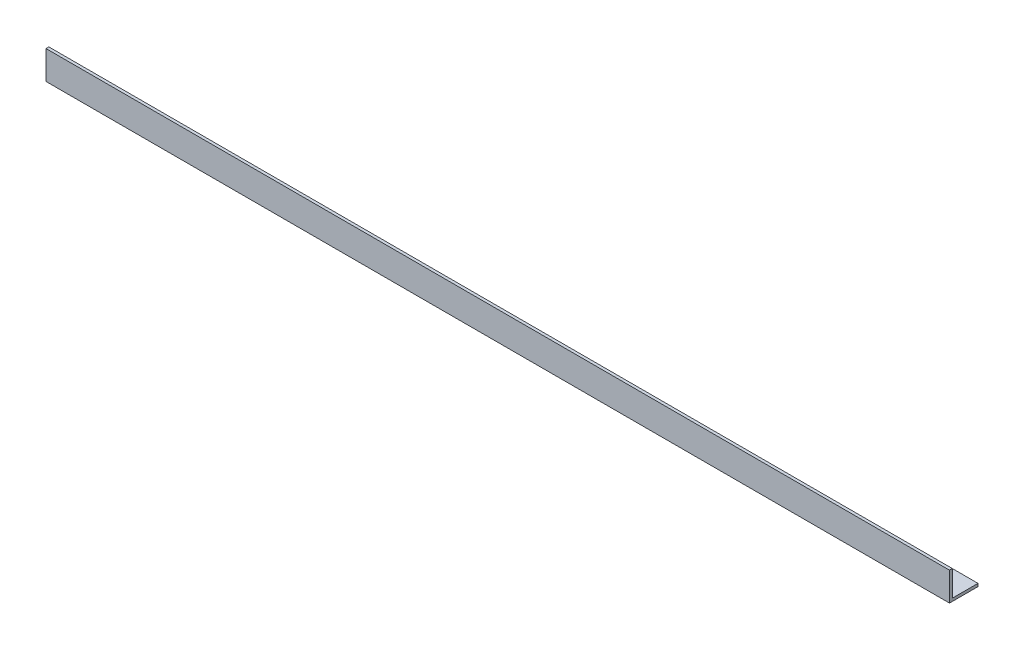
ISO-10303-21;
HEADER;
FILE_DESCRIPTION(('STEP AP214'),'2;1');
FILE_NAME('part.step','',(''),(''),'','','');
FILE_SCHEMA(('AUTOMOTIVE_DESIGN { 1 0 10303 214 1 1 1 1 }'));
ENDSEC;
DATA;
#1=APPLICATION_CONTEXT('core data for automotive mechanical design processes');
#2=APPLICATION_PROTOCOL_DEFINITION('international standard','automotive_design',2000,#1);
#3=PRODUCT_CONTEXT('',#1,'mechanical');
#4=PRODUCT('Part','Part','',(#3));
#5=PRODUCT_RELATED_PRODUCT_CATEGORY('part','',(#4));
#6=PRODUCT_DEFINITION_FORMATION('','',#4);
#7=PRODUCT_DEFINITION_CONTEXT('part definition',#1,'design');
#8=PRODUCT_DEFINITION('design','',#6,#7);
#9=PRODUCT_DEFINITION_SHAPE('','',#8);
#10=(LENGTH_UNIT() NAMED_UNIT(*) SI_UNIT(.MILLI.,.METRE.));
#11=(NAMED_UNIT(*) PLANE_ANGLE_UNIT() SI_UNIT($,.RADIAN.));
#12=(NAMED_UNIT(*) SI_UNIT($,.STERADIAN.) SOLID_ANGLE_UNIT());
#13=UNCERTAINTY_MEASURE_WITH_UNIT(LENGTH_MEASURE(1.E-05),#10,'distance_accuracy_value','');
#14=(GEOMETRIC_REPRESENTATION_CONTEXT(3) GLOBAL_UNCERTAINTY_ASSIGNED_CONTEXT((#13)) GLOBAL_UNIT_ASSIGNED_CONTEXT((#10,
#11,#12)) REPRESENTATION_CONTEXT('',''));
#15=CARTESIAN_POINT('',(0.,0.,0.));
#16=DIRECTION('',(0.,0.,1.));
#17=DIRECTION('',(1.,0.,0.));
#18=AXIS2_PLACEMENT_3D('',#15,#16,#17);
#19=CARTESIAN_POINT('',(475.,0.,-15.));
#20=DIRECTION('',(0.,1.,0.));
#21=DIRECTION('',(0.,0.,1.));
#22=AXIS2_PLACEMENT_3D('',#19,#20,#21);
#23=PLANE('',#22);
#24=DIRECTION('',(0.,0.,-1.));
#25=VECTOR('',#24,1.);
#26=CARTESIAN_POINT('',(0.,0.,-15.));
#27=LINE('',#26,#25);
#28=CARTESIAN_POINT('',(0.,0.,0.));
#29=VERTEX_POINT('',#28);
#30=CARTESIAN_POINT('',(0.,0.,-15.));
#31=VERTEX_POINT('',#30);
#32=EDGE_CURVE('E119',#29,#31,#27,.T.);
#33=ORIENTED_EDGE('',*,*,#32,.T.);
#34=DIRECTION('',(-1.,0.,0.));
#35=VECTOR('',#34,1.);
#36=CARTESIAN_POINT('',(475.,0.,-15.));
#37=LINE('',#36,#35);
#38=CARTESIAN_POINT('',(475.,0.,-15.));
#39=VERTEX_POINT('',#38);
#40=EDGE_CURVE('E11',#39,#31,#37,.T.);
#41=ORIENTED_EDGE('',*,*,#40,.F.);
#42=DIRECTION('',(0.,0.,-1.));
#43=VECTOR('',#42,1.);
#44=CARTESIAN_POINT('',(475.,0.,-15.));
#45=LINE('',#44,#43);
#46=CARTESIAN_POINT('',(475.,0.,0.));
#47=VERTEX_POINT('',#46);
#48=EDGE_CURVE('E129',#47,#39,#45,.T.);
#49=ORIENTED_EDGE('',*,*,#48,.F.);
#50=DIRECTION('',(-1.,0.,0.));
#51=VECTOR('',#50,1.);
#52=CARTESIAN_POINT('',(475.,0.,0.));
#53=LINE('',#52,#51);
#54=EDGE_CURVE('E115',#47,#29,#53,.T.);
#55=ORIENTED_EDGE('',*,*,#54,.T.);
#56=EDGE_LOOP('',(#33,#41,#49,#55));
#57=FACE_BOUND('',#56,.T.);
#58=ADVANCED_FACE('F35',(#57),#23,.F.);
#59=CARTESIAN_POINT('',(475.,1.49999999999998,-15.));
#60=DIRECTION('',(0.,0.,1.));
#61=DIRECTION('',(1.,0.,0.));
#62=AXIS2_PLACEMENT_3D('',#59,#60,#61);
#63=PLANE('',#62);
#64=DIRECTION('',(0.,1.,0.));
#65=VECTOR('',#64,1.);
#66=CARTESIAN_POINT('',(0.,1.49999999999998,-15.));
#67=LINE('',#66,#65);
#68=CARTESIAN_POINT('',(0.,1.49999999999998,-15.));
#69=VERTEX_POINT('',#68);
#70=EDGE_CURVE('E122',#31,#69,#67,.T.);
#71=ORIENTED_EDGE('',*,*,#70,.T.);
#72=DIRECTION('',(-1.,0.,0.));
#73=VECTOR('',#72,1.);
#74=CARTESIAN_POINT('',(475.,1.49999999999998,-15.));
#75=LINE('',#74,#73);
#76=CARTESIAN_POINT('',(475.,1.49999999999998,-15.));
#77=VERTEX_POINT('',#76);
#78=EDGE_CURVE('E43',#77,#69,#75,.T.);
#79=ORIENTED_EDGE('',*,*,#78,.F.);
#80=DIRECTION('',(0.,1.,0.));
#81=VECTOR('',#80,1.);
#82=CARTESIAN_POINT('',(475.,1.49999999999998,-15.));
#83=LINE('',#82,#81);
#84=EDGE_CURVE('E88',#39,#77,#83,.T.);
#85=ORIENTED_EDGE('',*,*,#84,.F.);
#86=ORIENTED_EDGE('',*,*,#40,.T.);
#87=EDGE_LOOP('',(#71,#79,#85,#86));
#88=FACE_BOUND('',#87,.T.);
#89=ADVANCED_FACE('F153',(#88),#63,.F.);
#90=CARTESIAN_POINT('',(475.,1.5,-1.50000000000002));
#91=DIRECTION('',(0.,-1.,0.));
#92=DIRECTION('',(0.,0.,-1.));
#93=AXIS2_PLACEMENT_3D('',#90,#91,#92);
#94=PLANE('',#93);
#95=DIRECTION('',(0.,0.,1.));
#96=VECTOR('',#95,1.);
#97=CARTESIAN_POINT('',(0.,1.5,-1.50000000000002));
#98=LINE('',#97,#96);
#99=CARTESIAN_POINT('',(0.,1.5,-1.50000000000002));
#100=VERTEX_POINT('',#99);
#101=EDGE_CURVE('E124',#69,#100,#98,.T.);
#102=ORIENTED_EDGE('',*,*,#101,.T.);
#103=DIRECTION('',(-1.,0.,0.));
#104=VECTOR('',#103,1.);
#105=CARTESIAN_POINT('',(475.,1.5,-1.50000000000002));
#106=LINE('',#105,#104);
#107=CARTESIAN_POINT('',(475.,1.5,-1.50000000000002));
#108=VERTEX_POINT('',#107);
#109=EDGE_CURVE('E110',#108,#100,#106,.T.);
#110=ORIENTED_EDGE('',*,*,#109,.F.);
#111=DIRECTION('',(0.,0.,1.));
#112=VECTOR('',#111,1.);
#113=CARTESIAN_POINT('',(475.,1.5,-1.50000000000002));
#114=LINE('',#113,#112);
#115=EDGE_CURVE('E101',#77,#108,#114,.T.);
#116=ORIENTED_EDGE('',*,*,#115,.F.);
#117=ORIENTED_EDGE('',*,*,#78,.T.);
#118=EDGE_LOOP('',(#102,#110,#116,#117));
#119=FACE_BOUND('',#118,.T.);
#120=ADVANCED_FACE('F135',(#119),#94,.F.);
#121=CARTESIAN_POINT('',(475.,15.,-1.5));
#122=DIRECTION('',(0.,0.,1.));
#123=DIRECTION('',(0.,-1.,0.));
#124=AXIS2_PLACEMENT_3D('',#121,#122,#123);
#125=PLANE('',#124);
#126=DIRECTION('',(0.,1.,0.));
#127=VECTOR('',#126,1.);
#128=CARTESIAN_POINT('',(0.,15.,-1.5));
#129=LINE('',#128,#127);
#130=CARTESIAN_POINT('',(0.,15.,-1.5));
#131=VERTEX_POINT('',#130);
#132=EDGE_CURVE('E109',#100,#131,#129,.T.);
#133=ORIENTED_EDGE('',*,*,#132,.T.);
#134=DIRECTION('',(-1.,0.,0.));
#135=VECTOR('',#134,1.);
#136=CARTESIAN_POINT('',(475.,15.,-1.5));
#137=LINE('',#136,#135);
#138=CARTESIAN_POINT('',(475.,15.,-1.5));
#139=VERTEX_POINT('',#138);
#140=EDGE_CURVE('E106',#139,#131,#137,.T.);
#141=ORIENTED_EDGE('',*,*,#140,.F.);
#142=DIRECTION('',(0.,1.,0.));
#143=VECTOR('',#142,1.);
#144=CARTESIAN_POINT('',(475.,15.,-1.5));
#145=LINE('',#144,#143);
#146=EDGE_CURVE('E95',#108,#139,#145,.T.);
#147=ORIENTED_EDGE('',*,*,#146,.F.);
#148=ORIENTED_EDGE('',*,*,#109,.T.);
#149=EDGE_LOOP('',(#133,#141,#147,#148));
#150=FACE_BOUND('',#149,.T.);
#151=ADVANCED_FACE('F107',(#150),#125,.F.);
#152=CARTESIAN_POINT('',(475.,15.,0.));
#153=DIRECTION('',(0.,-1.,0.));
#154=DIRECTION('',(0.,0.,-1.));
#155=AXIS2_PLACEMENT_3D('',#152,#153,#154);
#156=PLANE('',#155);
#157=DIRECTION('',(0.,0.,1.));
#158=VECTOR('',#157,1.);
#159=CARTESIAN_POINT('',(0.,15.,0.));
#160=LINE('',#159,#158);
#161=CARTESIAN_POINT('',(0.,15.,0.));
#162=VERTEX_POINT('',#161);
#163=EDGE_CURVE('E74',#131,#162,#160,.T.);
#164=ORIENTED_EDGE('',*,*,#163,.T.);
#165=DIRECTION('',(-1.,0.,0.));
#166=VECTOR('',#165,1.);
#167=CARTESIAN_POINT('',(475.,15.,0.));
#168=LINE('',#167,#166);
#169=CARTESIAN_POINT('',(475.,15.,0.));
#170=VERTEX_POINT('',#169);
#171=EDGE_CURVE('E111',#170,#162,#168,.T.);
#172=ORIENTED_EDGE('',*,*,#171,.F.);
#173=DIRECTION('',(0.,0.,1.));
#174=VECTOR('',#173,1.);
#175=CARTESIAN_POINT('',(475.,15.,0.));
#176=LINE('',#175,#174);
#177=EDGE_CURVE('E99',#139,#170,#176,.T.);
#178=ORIENTED_EDGE('',*,*,#177,.F.);
#179=ORIENTED_EDGE('',*,*,#140,.T.);
#180=EDGE_LOOP('',(#164,#172,#178,#179));
#181=FACE_BOUND('',#180,.T.);
#182=ADVANCED_FACE('F113',(#181),#156,.F.);
#183=CARTESIAN_POINT('',(475.,0.,0.));
#184=DIRECTION('',(0.,0.,-1.));
#185=DIRECTION('',(-1.,0.,0.));
#186=AXIS2_PLACEMENT_3D('',#183,#184,#185);
#187=PLANE('',#186);
#188=DIRECTION('',(0.,-1.,0.));
#189=VECTOR('',#188,1.);
#190=CARTESIAN_POINT('',(0.,0.,0.));
#191=LINE('',#190,#189);
#192=EDGE_CURVE('E80',#162,#29,#191,.T.);
#193=ORIENTED_EDGE('',*,*,#192,.T.);
#194=ORIENTED_EDGE('',*,*,#54,.F.);
#195=DIRECTION('',(0.,-1.,0.));
#196=VECTOR('',#195,1.);
#197=CARTESIAN_POINT('',(475.,0.,0.));
#198=LINE('',#197,#196);
#199=EDGE_CURVE('E51',#170,#47,#198,.T.);
#200=ORIENTED_EDGE('',*,*,#199,.F.);
#201=ORIENTED_EDGE('',*,*,#171,.T.);
#202=EDGE_LOOP('',(#193,#194,#200,#201));
#203=FACE_BOUND('',#202,.T.);
#204=ADVANCED_FACE('F142',(#203),#187,.F.);
#205=CARTESIAN_POINT('',(475.,0.,0.));
#206=DIRECTION('',(-1.,0.,0.));
#207=DIRECTION('',(0.,0.,1.));
#208=AXIS2_PLACEMENT_3D('',#205,#206,#207);
#209=PLANE('',#208);
#210=ORIENTED_EDGE('',*,*,#48,.T.);
#211=ORIENTED_EDGE('',*,*,#84,.T.);
#212=ORIENTED_EDGE('',*,*,#115,.T.);
#213=ORIENTED_EDGE('',*,*,#146,.T.);
#214=ORIENTED_EDGE('',*,*,#177,.T.);
#215=ORIENTED_EDGE('',*,*,#199,.T.);
#216=EDGE_LOOP('',(#210,#211,#212,#213,#214,#215));
#217=FACE_BOUND('',#216,.T.);
#218=ADVANCED_FACE('F97',(#217),#209,.F.);
#219=CARTESIAN_POINT('',(0.,0.,0.));
#220=DIRECTION('',(-1.,0.,0.));
#221=DIRECTION('',(0.,0.,1.));
#222=AXIS2_PLACEMENT_3D('',#219,#220,#221);
#223=PLANE('',#222);
#224=ORIENTED_EDGE('',*,*,#32,.F.);
#225=ORIENTED_EDGE('',*,*,#192,.F.);
#226=ORIENTED_EDGE('',*,*,#163,.F.);
#227=ORIENTED_EDGE('',*,*,#132,.F.);
#228=ORIENTED_EDGE('',*,*,#101,.F.);
#229=ORIENTED_EDGE('',*,*,#70,.F.);
#230=EDGE_LOOP('',(#224,#225,#226,#227,#228,#229));
#231=FACE_BOUND('',#230,.T.);
#232=ADVANCED_FACE('F138',(#231),#223,.T.);
#233=CLOSED_SHELL('',(#58,#89,#120,#151,#182,#204,#218,#232));
#234=MANIFOLD_SOLID_BREP('B2',#233);
#235=ADVANCED_BREP_SHAPE_REPRESENTATION('',(#18,#234),#14);
#236=SHAPE_DEFINITION_REPRESENTATION(#9,#235);
ENDSEC;
END-ISO-10303-21;
